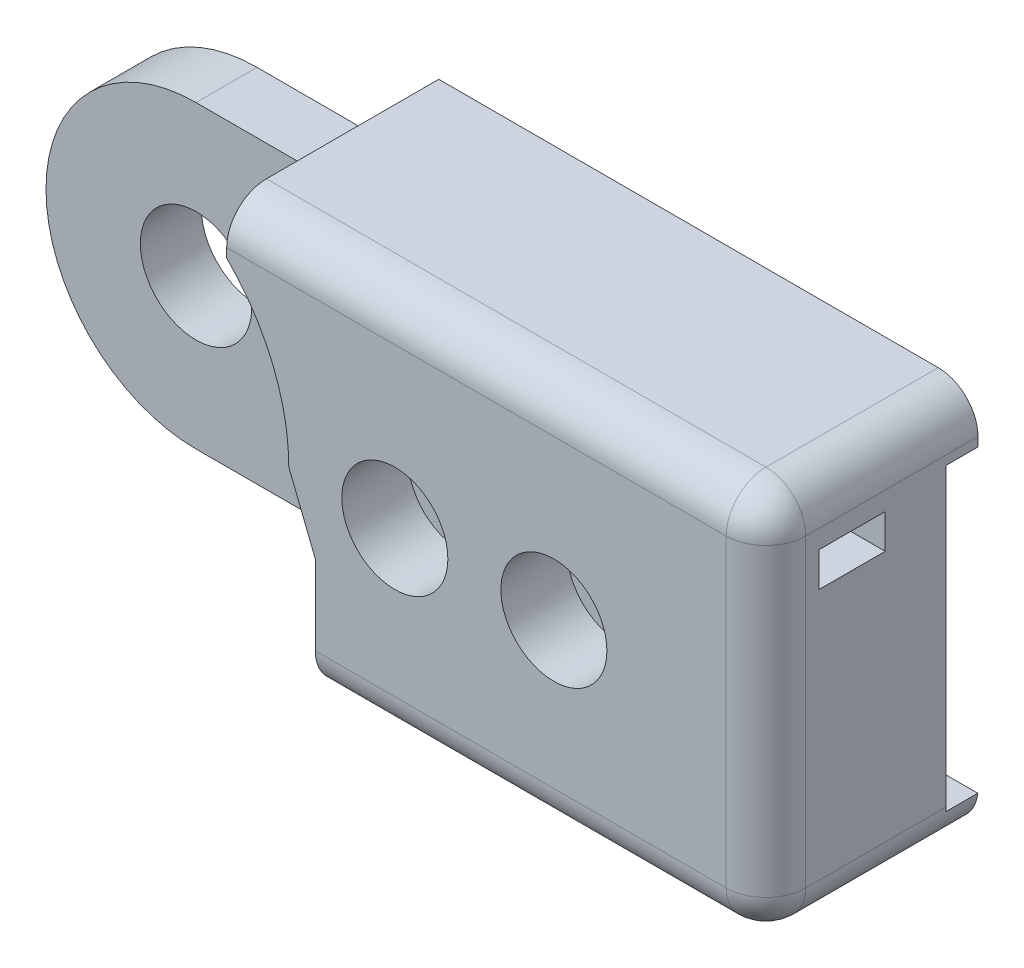
ISO-10303-21;
HEADER;
FILE_DESCRIPTION(('STEP AP214'),'2;1');
FILE_NAME('part.step','',(''),(''),'','','');
FILE_SCHEMA(('AUTOMOTIVE_DESIGN { 1 0 10303 214 1 1 1 1 }'));
ENDSEC;
DATA;
#1=APPLICATION_CONTEXT('core data for automotive mechanical design processes');
#2=APPLICATION_PROTOCOL_DEFINITION('international standard','automotive_design',2000,#1);
#3=PRODUCT_CONTEXT('',#1,'mechanical');
#4=PRODUCT('Part','Part','',(#3));
#5=PRODUCT_RELATED_PRODUCT_CATEGORY('part','',(#4));
#6=PRODUCT_DEFINITION_FORMATION('','',#4);
#7=PRODUCT_DEFINITION_CONTEXT('part definition',#1,'design');
#8=PRODUCT_DEFINITION('design','',#6,#7);
#9=PRODUCT_DEFINITION_SHAPE('','',#8);
#10=(LENGTH_UNIT() NAMED_UNIT(*) SI_UNIT(.MILLI.,.METRE.));
#11=(NAMED_UNIT(*) PLANE_ANGLE_UNIT() SI_UNIT($,.RADIAN.));
#12=(NAMED_UNIT(*) SI_UNIT($,.STERADIAN.) SOLID_ANGLE_UNIT());
#13=UNCERTAINTY_MEASURE_WITH_UNIT(LENGTH_MEASURE(1.E-05),#10,'distance_accuracy_value','');
#14=(GEOMETRIC_REPRESENTATION_CONTEXT(3) GLOBAL_UNCERTAINTY_ASSIGNED_CONTEXT((#13)) GLOBAL_UNIT_ASSIGNED_CONTEXT((#10,
#11,#12)) REPRESENTATION_CONTEXT('',''));
#15=CARTESIAN_POINT('',(0.,0.,0.));
#16=DIRECTION('',(0.,0.,1.));
#17=DIRECTION('',(1.,0.,0.));
#18=AXIS2_PLACEMENT_3D('',#15,#16,#17);
#19=CARTESIAN_POINT('',(0.,0.,-4.8));
#20=DIRECTION('',(0.,0.,-1.));
#21=DIRECTION('',(-1.,0.,0.));
#22=AXIS2_PLACEMENT_3D('',#19,#20,#21);
#23=PLANE('',#22);
#24=CARTESIAN_POINT('',(18.,0.,-4.8));
#25=DIRECTION('',(0.,0.,-1.));
#26=DIRECTION('',(-1.,0.,0.));
#27=AXIS2_PLACEMENT_3D('',#24,#25,#26);
#28=CIRCLE('',#27,2.5);
#29=CARTESIAN_POINT('',(15.5,0.,-4.8));
#30=VERTEX_POINT('',#29);
#31=EDGE_CURVE('E275',#30,#30,#28,.T.);
#32=ORIENTED_EDGE('',*,*,#31,.F.);
#33=EDGE_LOOP('',(#32));
#34=FACE_BOUND('',#33,.T.);
#35=CARTESIAN_POINT('',(12.,0.,-4.8));
#36=DIRECTION('',(0.,0.,-1.));
#37=DIRECTION('',(-1.,0.,0.));
#38=AXIS2_PLACEMENT_3D('',#35,#36,#37);
#39=CIRCLE('',#38,2.5);
#40=CARTESIAN_POINT('',(9.50000000000001,0.,-4.8));
#41=VERTEX_POINT('',#40);
#42=EDGE_CURVE('E285',#41,#41,#39,.T.);
#43=ORIENTED_EDGE('',*,*,#42,.F.);
#44=EDGE_LOOP('',(#43));
#45=FACE_BOUND('',#44,.T.);
#46=CARTESIAN_POINT('',(0.,0.,-4.8));
#47=DIRECTION('',(0.,0.,-1.));
#48=DIRECTION('',(-1.,0.,0.));
#49=AXIS2_PLACEMENT_3D('',#46,#47,#48);
#50=CIRCLE('',#49,2.1);
#51=CARTESIAN_POINT('',(-2.1,0.,-4.8));
#52=VERTEX_POINT('',#51);
#53=EDGE_CURVE('E293',#52,#52,#50,.T.);
#54=ORIENTED_EDGE('',*,*,#53,.F.);
#55=EDGE_LOOP('',(#54));
#56=FACE_BOUND('',#55,.T.);
#57=DIRECTION('',(0.,-1.,0.));
#58=VECTOR('',#57,1.);
#59=CARTESIAN_POINT('',(26.,0.,-4.8));
#60=LINE('',#59,#58);
#61=CARTESIAN_POINT('',(26.,5.65685424949239,-4.8));
#62=VERTEX_POINT('',#61);
#63=CARTESIAN_POINT('',(26.,-5.50163526528755,-4.8));
#64=VERTEX_POINT('',#63);
#65=EDGE_CURVE('E316',#62,#64,#60,.T.);
#66=ORIENTED_EDGE('',*,*,#65,.T.);
#67=CARTESIAN_POINT('',(24.5,-5.50163526528755,-4.8));
#68=DIRECTION('',(0.,0.,-1.));
#69=DIRECTION('',(-1.,0.,0.));
#70=AXIS2_PLACEMENT_3D('',#67,#68,#69);
#71=CIRCLE('',#70,1.5);
#72=CARTESIAN_POINT('',(25.9916168703616,-5.6599991249669,-4.8));
#73=VERTEX_POINT('',#72);
#74=EDGE_CURVE('E450',#64,#73,#71,.T.);
#75=ORIENTED_EDGE('',*,*,#74,.T.);
#76=DIRECTION('',(1.,0.,0.));
#77=VECTOR('',#76,1.);
#78=CARTESIAN_POINT('',(9.00000000000001,-5.6599991249669,-4.8));
#79=LINE('',#78,#77);
#80=CARTESIAN_POINT('',(9.00000000000001,-5.6599991249669,-4.8));
#81=VERTEX_POINT('',#80);
#82=EDGE_CURVE('E209',#81,#73,#79,.T.);
#83=ORIENTED_EDGE('',*,*,#82,.F.);
#84=DIRECTION('',(-1.,0.,0.));
#85=VECTOR('',#84,1.);
#86=CARTESIAN_POINT('',(0.,-5.6599991249669,-4.8));
#87=LINE('',#86,#85);
#88=CARTESIAN_POINT('',(0.,-5.6599991249669,-4.8));
#89=VERTEX_POINT('',#88);
#90=EDGE_CURVE('E305',#81,#89,#87,.T.);
#91=ORIENTED_EDGE('',*,*,#90,.T.);
#92=CARTESIAN_POINT('',(0.,0.,-4.8));
#93=DIRECTION('',(0.,0.,-1.));
#94=DIRECTION('',(-1.,0.,0.));
#95=AXIS2_PLACEMENT_3D('',#92,#93,#94);
#96=CIRCLE('',#95,5.65999868763295);
#97=CARTESIAN_POINT('',(0.,5.65999912496691,-4.8));
#98=VERTEX_POINT('',#97);
#99=EDGE_CURVE('E309',#89,#98,#96,.T.);
#100=ORIENTED_EDGE('',*,*,#99,.T.);
#101=DIRECTION('',(0.999999845465009,-0.000555940607591913,0.));
#102=VECTOR('',#101,1.);
#103=CARTESIAN_POINT('',(0.00314662286624039,5.65999737563121,-4.8));
#104=LINE('',#103,#102);
#105=CARTESIAN_POINT('',(5.65685424949238,5.65685424949239,-4.8));
#106=VERTEX_POINT('',#105);
#107=EDGE_CURVE('E313',#98,#106,#104,.T.);
#108=ORIENTED_EDGE('',*,*,#107,.T.);
#109=DIRECTION('',(-1.,0.,0.));
#110=VECTOR('',#109,1.);
#111=CARTESIAN_POINT('',(26.,5.65685424949239,-4.8));
#112=LINE('',#111,#110);
#113=EDGE_CURVE('E228',#62,#106,#112,.T.);
#114=ORIENTED_EDGE('',*,*,#113,.F.);
#115=EDGE_LOOP('',(#66,#75,#83,#91,#100,#108,#114));
#116=FACE_BOUND('',#115,.T.);
#117=ADVANCED_FACE('F40',(#34,#45,#56,#116),#23,.T.);
#118=CARTESIAN_POINT('',(18.,0.,3.2));
#119=DIRECTION('',(0.,0.,-1.));
#120=DIRECTION('',(-1.,0.,0.));
#121=AXIS2_PLACEMENT_3D('',#118,#119,#120);
#122=CYLINDRICAL_SURFACE('',#121,0.950000000000001);
#123=CARTESIAN_POINT('',(18.,0.,-6.));
#124=DIRECTION('',(0.,0.,-1.));
#125=DIRECTION('',(-1.,0.,0.));
#126=AXIS2_PLACEMENT_3D('',#123,#124,#125);
#127=CIRCLE('',#126,0.950000000000001);
#128=CARTESIAN_POINT('',(17.05,0.,-6.));
#129=VERTEX_POINT('',#128);
#130=EDGE_CURVE('E271',#129,#129,#127,.T.);
#131=ORIENTED_EDGE('',*,*,#130,.T.);
#132=EDGE_LOOP('',(#131));
#133=FACE_BOUND('',#132,.T.);
#134=CARTESIAN_POINT('',(18.,0.,-0.5));
#135=DIRECTION('',(0.,0.,1.));
#136=DIRECTION('',(1.,0.,0.));
#137=AXIS2_PLACEMENT_3D('',#134,#135,#136);
#138=CIRCLE('',#137,0.950000000000001);
#139=CARTESIAN_POINT('',(18.95,0.,-0.5));
#140=VERTEX_POINT('',#139);
#141=EDGE_CURVE('E280',#140,#140,#138,.F.);
#142=ORIENTED_EDGE('',*,*,#141,.F.);
#143=EDGE_LOOP('',(#142));
#144=FACE_BOUND('',#143,.T.);
#145=ADVANCED_FACE('F573',(#133,#144),#122,.F.);
#146=CARTESIAN_POINT('',(12.,0.,3.2));
#147=DIRECTION('',(0.,0.,-1.));
#148=DIRECTION('',(-1.,0.,0.));
#149=AXIS2_PLACEMENT_3D('',#146,#147,#148);
#150=CYLINDRICAL_SURFACE('',#149,0.949999999999999);
#151=CARTESIAN_POINT('',(12.,0.,-6.));
#152=DIRECTION('',(0.,0.,-1.));
#153=DIRECTION('',(-1.,0.,0.));
#154=AXIS2_PLACEMENT_3D('',#151,#152,#153);
#155=CIRCLE('',#154,0.949999999999999);
#156=CARTESIAN_POINT('',(11.05,0.,-6.));
#157=VERTEX_POINT('',#156);
#158=EDGE_CURVE('E276',#157,#157,#155,.T.);
#159=ORIENTED_EDGE('',*,*,#158,.T.);
#160=EDGE_LOOP('',(#159));
#161=FACE_BOUND('',#160,.T.);
#162=CARTESIAN_POINT('',(12.,0.,-0.5));
#163=DIRECTION('',(0.,0.,1.));
#164=DIRECTION('',(1.,0.,0.));
#165=AXIS2_PLACEMENT_3D('',#162,#163,#164);
#166=CIRCLE('',#165,0.949999999999999);
#167=CARTESIAN_POINT('',(12.95,0.,-0.5));
#168=VERTEX_POINT('',#167);
#169=EDGE_CURVE('E259',#168,#168,#166,.F.);
#170=ORIENTED_EDGE('',*,*,#169,.F.);
#171=EDGE_LOOP('',(#170));
#172=FACE_BOUND('',#171,.T.);
#173=ADVANCED_FACE('F579',(#161,#172),#150,.F.);
#174=CARTESIAN_POINT('',(0.,0.,2.));
#175=DIRECTION('',(0.,0.,-1.));
#176=DIRECTION('',(-1.,0.,0.));
#177=AXIS2_PLACEMENT_3D('',#174,#175,#176);
#178=CYLINDRICAL_SURFACE('',#177,8.00000000000001);
#179=CARTESIAN_POINT('',(0.,0.,-2.5));
#180=DIRECTION('',(0.,0.,1.));
#181=DIRECTION('',(-1.,0.,0.));
#182=AXIS2_PLACEMENT_3D('',#179,#180,#181);
#183=CIRCLE('',#182,8.00000000000001);
#184=CARTESIAN_POINT('',(5.99394120241067,5.29836473471238,-2.5));
#185=VERTEX_POINT('',#184);
#186=CARTESIAN_POINT('',(5.65685424949238,5.65685424949239,-2.5));
#187=VERTEX_POINT('',#186);
#188=EDGE_CURVE('E382',#185,#187,#183,.T.);
#189=ORIENTED_EDGE('',*,*,#188,.F.);
#190=DIRECTION('',(0.,0.,-1.));
#191=VECTOR('',#190,1.);
#192=CARTESIAN_POINT('',(5.99394120241067,5.29836473471238,2.));
#193=LINE('',#192,#191);
#194=CARTESIAN_POINT('',(5.99394120241067,5.29836473471238,0.));
#195=VERTEX_POINT('',#194);
#196=EDGE_CURVE('E371',#185,#195,#193,.F.);
#197=ORIENTED_EDGE('',*,*,#196,.T.);
#198=CARTESIAN_POINT('',(0.,0.,0.));
#199=DIRECTION('',(0.,0.,1.));
#200=DIRECTION('',(1.,0.,0.));
#201=AXIS2_PLACEMENT_3D('',#198,#199,#200);
#202=CIRCLE('',#201,8.00000000000001);
#203=CARTESIAN_POINT('',(6.9291470938499,3.99836473471238,0.));
#204=VERTEX_POINT('',#203);
#205=EDGE_CURVE('E375',#195,#204,#202,.F.);
#206=ORIENTED_EDGE('',*,*,#205,.T.);
#207=DIRECTION('',(0.,0.,-1.));
#208=VECTOR('',#207,1.);
#209=CARTESIAN_POINT('',(6.9291470938499,3.99836473471238,2.));
#210=LINE('',#209,#208);
#211=CARTESIAN_POINT('',(6.9291470938499,3.99836473471238,-2.5));
#212=VERTEX_POINT('',#211);
#213=EDGE_CURVE('E363',#204,#212,#210,.T.);
#214=ORIENTED_EDGE('',*,*,#213,.T.);
#215=CARTESIAN_POINT('',(8.00000000000001,0.,-2.5));
#216=VERTEX_POINT('',#215);
#217=EDGE_CURVE('E383',#216,#212,#183,.T.);
#218=ORIENTED_EDGE('',*,*,#217,.F.);
#219=DIRECTION('',(0.,0.,-1.));
#220=VECTOR('',#219,1.);
#221=CARTESIAN_POINT('',(8.00000000000001,0.,2.));
#222=LINE('',#221,#220);
#223=CARTESIAN_POINT('',(8.00000000000001,0.,2.));
#224=VERTEX_POINT('',#223);
#225=EDGE_CURVE('E409',#224,#216,#222,.T.);
#226=ORIENTED_EDGE('',*,*,#225,.F.);
#227=CARTESIAN_POINT('',(0.,0.,2.));
#228=DIRECTION('',(0.,0.,-1.));
#229=DIRECTION('',(1.,0.,0.));
#230=AXIS2_PLACEMENT_3D('',#227,#228,#229);
#231=CIRCLE('',#230,8.00000000000001);
#232=CARTESIAN_POINT('',(5.65685424949238,5.65685424949239,2.));
#233=VERTEX_POINT('',#232);
#234=EDGE_CURVE('E386',#233,#224,#231,.T.);
#235=ORIENTED_EDGE('',*,*,#234,.F.);
#236=DIRECTION('',(0.,0.,-1.));
#237=VECTOR('',#236,1.);
#238=CARTESIAN_POINT('',(5.65685424949238,5.65685424949239,2.));
#239=LINE('',#238,#237);
#240=EDGE_CURVE('E400',#233,#187,#239,.T.);
#241=ORIENTED_EDGE('',*,*,#240,.T.);
#242=EDGE_LOOP('',(#189,#197,#206,#214,#218,#226,#235,#241));
#243=FACE_BOUND('',#242,.T.);
#244=ADVANCED_FACE('F630',(#243),#178,.F.);
#245=CARTESIAN_POINT('',(8.00000000000001,0.,2.));
#246=DIRECTION('',(0.92856038867315,0.371181363469624,0.));
#247=DIRECTION('',(-0.371181363469624,0.92856038867315,0.));
#248=AXIS2_PLACEMENT_3D('',#245,#246,#247);
#249=PLANE('',#248);
#250=ORIENTED_EDGE('',*,*,#225,.T.);
#251=DIRECTION('',(-0.371181363469624,0.92856038867315,0.));
#252=VECTOR('',#251,1.);
#253=CARTESIAN_POINT('',(8.00000000000001,0.,-2.5));
#254=LINE('',#253,#252);
#255=CARTESIAN_POINT('',(9.00000000000001,-2.50163526528762,-2.5));
#256=VERTEX_POINT('',#255);
#257=EDGE_CURVE('E379',#256,#216,#254,.T.);
#258=ORIENTED_EDGE('',*,*,#257,.F.);
#259=DIRECTION('',(0.,0.,-1.));
#260=VECTOR('',#259,1.);
#261=CARTESIAN_POINT('',(9.00000000000001,-2.50163526528762,2.));
#262=LINE('',#261,#260);
#263=CARTESIAN_POINT('',(9.00000000000001,-2.50163526528762,2.));
#264=VERTEX_POINT('',#263);
#265=EDGE_CURVE('E198',#264,#256,#262,.T.);
#266=ORIENTED_EDGE('',*,*,#265,.F.);
#267=DIRECTION('',(0.371181363469624,-0.92856038867315,0.));
#268=VECTOR('',#267,1.);
#269=CARTESIAN_POINT('',(8.00000000000001,0.,2.));
#270=LINE('',#269,#268);
#271=EDGE_CURVE('E390',#224,#264,#270,.T.);
#272=ORIENTED_EDGE('',*,*,#271,.F.);
#273=EDGE_LOOP('',(#250,#258,#266,#272));
#274=FACE_BOUND('',#273,.T.);
#275=ADVANCED_FACE('F517',(#274),#249,.F.);
#276=CARTESIAN_POINT('',(9.00000000000001,-7.00163526528755,2.));
#277=DIRECTION('',(1.,0.,0.));
#278=DIRECTION('',(0.,0.,-1.));
#279=AXIS2_PLACEMENT_3D('',#276,#277,#278);
#280=PLANE('',#279);
#281=DIRECTION('',(0.,0.,-1.));
#282=VECTOR('',#281,1.);
#283=CARTESIAN_POINT('',(9.00000000000001,-7.00163526528755,2.));
#284=LINE('',#283,#282);
#285=CARTESIAN_POINT('',(9.00000000000001,-7.00163526528755,0.5));
#286=VERTEX_POINT('',#285);
#287=CARTESIAN_POINT('',(9.00000000000001,-7.00163526528755,-6.));
#288=VERTEX_POINT('',#287);
#289=EDGE_CURVE('E187',#286,#288,#284,.T.);
#290=ORIENTED_EDGE('',*,*,#289,.F.);
#291=CARTESIAN_POINT('',(9.00000000000001,-5.50163526528755,0.5));
#292=DIRECTION('',(1.,0.,0.));
#293=DIRECTION('',(0.,0.,-1.));
#294=AXIS2_PLACEMENT_3D('',#291,#292,#293);
#295=CIRCLE('',#294,1.5);
#296=CARTESIAN_POINT('',(9.00000000000001,-5.50163526528755,2.));
#297=VERTEX_POINT('',#296);
#298=EDGE_CURVE('E463',#286,#297,#295,.F.);
#299=ORIENTED_EDGE('',*,*,#298,.T.);
#300=DIRECTION('',(0.,-1.,0.));
#301=VECTOR('',#300,1.);
#302=CARTESIAN_POINT('',(9.00000000000001,-7.00163526528755,2.));
#303=LINE('',#302,#301);
#304=EDGE_CURVE('E393',#264,#297,#303,.T.);
#305=ORIENTED_EDGE('',*,*,#304,.F.);
#306=ORIENTED_EDGE('',*,*,#265,.T.);
#307=DIRECTION('',(0.,1.,0.));
#308=VECTOR('',#307,1.);
#309=CARTESIAN_POINT('',(9.00000000000001,-7.00163526528755,-2.5));
#310=LINE('',#309,#308);
#311=CARTESIAN_POINT('',(9.00000000000001,-5.6599991249669,-2.5));
#312=VERTEX_POINT('',#311);
#313=EDGE_CURVE('E348',#312,#256,#310,.T.);
#314=ORIENTED_EDGE('',*,*,#313,.F.);
#315=DIRECTION('',(0.,0.,1.));
#316=VECTOR('',#315,1.);
#317=CARTESIAN_POINT('',(9.00000000000001,-5.6599991249669,-4.8));
#318=LINE('',#317,#316);
#319=EDGE_CURVE('E320',#81,#312,#318,.T.);
#320=ORIENTED_EDGE('',*,*,#319,.F.);
#321=DIRECTION('',(0.,0.,1.));
#322=VECTOR('',#321,1.);
#323=CARTESIAN_POINT('',(9.00000000000001,-5.6599991249669,-6.));
#324=LINE('',#323,#322);
#325=CARTESIAN_POINT('',(9.00000000000001,-5.6599991249669,-6.));
#326=VERTEX_POINT('',#325);
#327=EDGE_CURVE('E214',#326,#81,#324,.T.);
#328=ORIENTED_EDGE('',*,*,#327,.F.);
#329=DIRECTION('',(0.,1.,0.));
#330=VECTOR('',#329,1.);
#331=CARTESIAN_POINT('',(9.00000000000001,-7.00163526528755,-6.));
#332=LINE('',#331,#330);
#333=EDGE_CURVE('E204',#288,#326,#332,.T.);
#334=ORIENTED_EDGE('',*,*,#333,.F.);
#335=EDGE_LOOP('',(#290,#299,#305,#306,#314,#320,#328,#334));
#336=FACE_BOUND('',#335,.T.);
#337=ADVANCED_FACE('F211',(#336),#280,.F.);
#338=CARTESIAN_POINT('',(26.,-7.00163526528755,2.));
#339=DIRECTION('',(0.,1.,0.));
#340=DIRECTION('',(-1.,0.,0.));
#341=AXIS2_PLACEMENT_3D('',#338,#339,#340);
#342=PLANE('',#341);
#343=CARTESIAN_POINT('',(22.,-7.00163526528755,-1.));
#344=DIRECTION('',(0.,-1.,0.));
#345=DIRECTION('',(1.,0.,0.));
#346=AXIS2_PLACEMENT_3D('',#343,#344,#345);
#347=CIRCLE('',#346,0.950000000000001);
#348=CARTESIAN_POINT('',(22.95,-7.00163526528755,-1.));
#349=VERTEX_POINT('',#348);
#350=EDGE_CURVE('E676',#349,#349,#347,.T.);
#351=ORIENTED_EDGE('',*,*,#350,.F.);
#352=EDGE_LOOP('',(#351));
#353=FACE_BOUND('',#352,.T.);
#354=CARTESIAN_POINT('',(18.,-7.00163526528755,-1.));
#355=DIRECTION('',(0.,-1.,0.));
#356=DIRECTION('',(1.,0.,0.));
#357=AXIS2_PLACEMENT_3D('',#354,#355,#356);
#358=CIRCLE('',#357,0.950000000000001);
#359=CARTESIAN_POINT('',(18.95,-7.00163526528755,-1.));
#360=VERTEX_POINT('',#359);
#361=EDGE_CURVE('E685',#360,#360,#358,.T.);
#362=ORIENTED_EDGE('',*,*,#361,.F.);
#363=EDGE_LOOP('',(#362));
#364=FACE_BOUND('',#363,.T.);
#365=DIRECTION('',(-1.,0.,0.));
#366=VECTOR('',#365,1.);
#367=CARTESIAN_POINT('',(26.,-7.00163526528755,-6.));
#368=LINE('',#367,#366);
#369=CARTESIAN_POINT('',(24.5,-7.00163526528755,-6.));
#370=VERTEX_POINT('',#369);
#371=EDGE_CURVE('E190',#370,#288,#368,.T.);
#372=ORIENTED_EDGE('',*,*,#371,.F.);
#373=DIRECTION('',(0.,0.,-1.));
#374=VECTOR('',#373,1.);
#375=CARTESIAN_POINT('',(24.5,-7.00163526528755,2.));
#376=LINE('',#375,#374);
#377=CARTESIAN_POINT('',(24.5,-7.00163526528755,0.5));
#378=VERTEX_POINT('',#377);
#379=EDGE_CURVE('E460',#370,#378,#376,.F.);
#380=ORIENTED_EDGE('',*,*,#379,.T.);
#381=DIRECTION('',(1.,0.,0.));
#382=VECTOR('',#381,1.);
#383=CARTESIAN_POINT('',(9.00000000000001,-7.00163526528755,0.5));
#384=LINE('',#383,#382);
#385=EDGE_CURVE('E193',#378,#286,#384,.F.);
#386=ORIENTED_EDGE('',*,*,#385,.T.);
#387=ORIENTED_EDGE('',*,*,#289,.T.);
#388=EDGE_LOOP('',(#372,#380,#386,#387));
#389=FACE_BOUND('',#388,.T.);
#390=ADVANCED_FACE('F189',(#353,#364,#389),#342,.F.);
#391=CARTESIAN_POINT('',(26.,-7.00163526528755,2.));
#392=DIRECTION('',(-1.,0.,0.));
#393=DIRECTION('',(0.,0.,1.));
#394=AXIS2_PLACEMENT_3D('',#391,#392,#393);
#395=PLANE('',#394);
#396=DIRECTION('',(0.,0.,-1.));
#397=VECTOR('',#396,1.);
#398=CARTESIAN_POINT('',(26.,5.29836473471238,2.));
#399=LINE('',#398,#397);
#400=CARTESIAN_POINT('',(26.,5.29836473471238,0.));
#401=VERTEX_POINT('',#400);
#402=CARTESIAN_POINT('',(26.,5.29836473471238,-2.5));
#403=VERTEX_POINT('',#402);
#404=EDGE_CURVE('E367',#401,#403,#399,.T.);
#405=ORIENTED_EDGE('',*,*,#404,.T.);
#406=DIRECTION('',(0.,-1.,0.));
#407=VECTOR('',#406,1.);
#408=CARTESIAN_POINT('',(26.,0.,-2.5));
#409=LINE('',#408,#407);
#410=CARTESIAN_POINT('',(26.,3.99836473471238,-2.5));
#411=VERTEX_POINT('',#410);
#412=EDGE_CURVE('E310',#403,#411,#409,.T.);
#413=ORIENTED_EDGE('',*,*,#412,.T.);
#414=DIRECTION('',(0.,0.,1.));
#415=VECTOR('',#414,1.);
#416=CARTESIAN_POINT('',(26.,3.99836473471238,2.));
#417=LINE('',#416,#415);
#418=CARTESIAN_POINT('',(26.,3.99836473471238,0.));
#419=VERTEX_POINT('',#418);
#420=EDGE_CURVE('E359',#411,#419,#417,.T.);
#421=ORIENTED_EDGE('',*,*,#420,.T.);
#422=DIRECTION('',(0.,1.,0.));
#423=VECTOR('',#422,1.);
#424=CARTESIAN_POINT('',(26.,-7.00163526528755,0.));
#425=LINE('',#424,#423);
#426=EDGE_CURVE('E421',#419,#401,#425,.T.);
#427=ORIENTED_EDGE('',*,*,#426,.T.);
#428=EDGE_LOOP('',(#405,#413,#421,#427));
#429=FACE_BOUND('',#428,.T.);
#430=DIRECTION('',(0.,1.,0.));
#431=VECTOR('',#430,1.);
#432=CARTESIAN_POINT('',(26.,-7.00163526528755,0.5));
#433=LINE('',#432,#431);
#434=CARTESIAN_POINT('',(26.,5.99836473471239,0.5));
#435=VERTEX_POINT('',#434);
#436=CARTESIAN_POINT('',(26.,-5.50163526528755,0.5));
#437=VERTEX_POINT('',#436);
#438=EDGE_CURVE('E444',#435,#437,#433,.F.);
#439=ORIENTED_EDGE('',*,*,#438,.T.);
#440=DIRECTION('',(0.,0.,-1.));
#441=VECTOR('',#440,1.);
#442=CARTESIAN_POINT('',(26.,-5.50163526528755,2.));
#443=LINE('',#442,#441);
#444=EDGE_CURVE('E447',#437,#64,#443,.T.);
#445=ORIENTED_EDGE('',*,*,#444,.T.);
#446=ORIENTED_EDGE('',*,*,#65,.F.);
#447=DIRECTION('',(0.,0.,1.));
#448=VECTOR('',#447,1.);
#449=CARTESIAN_POINT('',(26.,5.65685424949239,-6.));
#450=LINE('',#449,#448);
#451=CARTESIAN_POINT('',(26.,5.65685424949239,-6.));
#452=VERTEX_POINT('',#451);
#453=EDGE_CURVE('E243',#452,#62,#450,.T.);
#454=ORIENTED_EDGE('',*,*,#453,.F.);
#455=DIRECTION('',(0.,-1.,0.));
#456=VECTOR('',#455,1.);
#457=CARTESIAN_POINT('',(26.,7.49836473471239,-6.));
#458=LINE('',#457,#456);
#459=CARTESIAN_POINT('',(26.,5.99836473471239,-6.));
#460=VERTEX_POINT('',#459);
#461=EDGE_CURVE('E240',#460,#452,#458,.T.);
#462=ORIENTED_EDGE('',*,*,#461,.F.);
#463=DIRECTION('',(0.,0.,-1.));
#464=VECTOR('',#463,1.);
#465=CARTESIAN_POINT('',(26.,5.99836473471239,2.));
#466=LINE('',#465,#464);
#467=EDGE_CURVE('E441',#460,#435,#466,.F.);
#468=ORIENTED_EDGE('',*,*,#467,.T.);
#469=EDGE_LOOP('',(#439,#445,#446,#454,#462,#468));
#470=FACE_BOUND('',#469,.T.);
#471=ADVANCED_FACE('F536',(#429,#470),#395,.F.);
#472=CARTESIAN_POINT('',(5.65685424949238,7.49836473471238,2.));
#473=DIRECTION('',(0.,-1.,0.));
#474=DIRECTION('',(1.,0.,0.));
#475=AXIS2_PLACEMENT_3D('',#472,#473,#474);
#476=PLANE('',#475);
#477=DIRECTION('',(0.,0.,-1.));
#478=VECTOR('',#477,1.);
#479=CARTESIAN_POINT('',(5.65685424949238,7.49836473471238,2.));
#480=LINE('',#479,#478);
#481=CARTESIAN_POINT('',(5.65685424949238,7.49836473471238,0.5));
#482=VERTEX_POINT('',#481);
#483=CARTESIAN_POINT('',(5.65685424949238,7.49836473471238,-6.));
#484=VERTEX_POINT('',#483);
#485=EDGE_CURVE('E199',#482,#484,#480,.T.);
#486=ORIENTED_EDGE('',*,*,#485,.F.);
#487=DIRECTION('',(-1.,0.,0.));
#488=VECTOR('',#487,1.);
#489=CARTESIAN_POINT('',(26.,7.49836473471239,0.5));
#490=LINE('',#489,#488);
#491=CARTESIAN_POINT('',(24.5,7.49836473471239,0.5));
#492=VERTEX_POINT('',#491);
#493=EDGE_CURVE('E50',#482,#492,#490,.F.);
#494=ORIENTED_EDGE('',*,*,#493,.T.);
#495=DIRECTION('',(0.,0.,-1.));
#496=VECTOR('',#495,1.);
#497=CARTESIAN_POINT('',(24.5,7.49836473471239,2.));
#498=LINE('',#497,#496);
#499=CARTESIAN_POINT('',(24.5,7.49836473471239,-6.));
#500=VERTEX_POINT('',#499);
#501=EDGE_CURVE('E61',#492,#500,#498,.T.);
#502=ORIENTED_EDGE('',*,*,#501,.T.);
#503=DIRECTION('',(1.,0.,0.));
#504=VECTOR('',#503,1.);
#505=CARTESIAN_POINT('',(5.65685424949238,7.49836473471238,-6.));
#506=LINE('',#505,#504);
#507=EDGE_CURVE('E237',#484,#500,#506,.T.);
#508=ORIENTED_EDGE('',*,*,#507,.F.);
#509=EDGE_LOOP('',(#486,#494,#502,#508));
#510=FACE_BOUND('',#509,.T.);
#511=ADVANCED_FACE('F553',(#510),#476,.F.);
#512=CARTESIAN_POINT('',(5.65685424949238,5.65685424949239,2.));
#513=DIRECTION('',(1.,0.,0.));
#514=DIRECTION('',(0.,0.,-1.));
#515=AXIS2_PLACEMENT_3D('',#512,#513,#514);
#516=PLANE('',#515);
#517=DIRECTION('',(0.,-1.,0.));
#518=VECTOR('',#517,1.);
#519=CARTESIAN_POINT('',(5.65685424949238,5.65685424949239,2.));
#520=LINE('',#519,#518);
#521=CARTESIAN_POINT('',(5.65685424949238,5.99836473471239,2.));
#522=VERTEX_POINT('',#521);
#523=EDGE_CURVE('E397',#522,#233,#520,.T.);
#524=ORIENTED_EDGE('',*,*,#523,.F.);
#525=CARTESIAN_POINT('',(5.65685424949238,5.99836473471239,0.5));
#526=DIRECTION('',(1.,0.,0.));
#527=DIRECTION('',(0.,0.,-1.));
#528=AXIS2_PLACEMENT_3D('',#525,#526,#527);
#529=CIRCLE('',#528,1.5);
#530=EDGE_CURVE('E466',#522,#482,#529,.F.);
#531=ORIENTED_EDGE('',*,*,#530,.T.);
#532=ORIENTED_EDGE('',*,*,#485,.T.);
#533=DIRECTION('',(0.,1.,0.));
#534=VECTOR('',#533,1.);
#535=CARTESIAN_POINT('',(5.65685424949238,5.65685424949239,-6.));
#536=LINE('',#535,#534);
#537=CARTESIAN_POINT('',(5.65685424949238,5.65685424949239,-6.));
#538=VERTEX_POINT('',#537);
#539=EDGE_CURVE('E233',#538,#484,#536,.T.);
#540=ORIENTED_EDGE('',*,*,#539,.F.);
#541=DIRECTION('',(0.,0.,1.));
#542=VECTOR('',#541,1.);
#543=CARTESIAN_POINT('',(5.65685424949238,5.65685424949239,-6.));
#544=LINE('',#543,#542);
#545=EDGE_CURVE('E250',#538,#106,#544,.T.);
#546=ORIENTED_EDGE('',*,*,#545,.T.);
#547=DIRECTION('',(0.,0.,1.));
#548=VECTOR('',#547,1.);
#549=CARTESIAN_POINT('',(5.65685424949238,5.65685424949239,-4.8));
#550=LINE('',#549,#548);
#551=EDGE_CURVE('E336',#106,#187,#550,.T.);
#552=ORIENTED_EDGE('',*,*,#551,.T.);
#553=ORIENTED_EDGE('',*,*,#240,.F.);
#554=EDGE_LOOP('',(#524,#531,#532,#540,#546,#552,#553));
#555=FACE_BOUND('',#554,.T.);
#556=ADVANCED_FACE('F551',(#555),#516,.F.);
#557=CARTESIAN_POINT('',(0.,0.,2.));
#558=DIRECTION('',(0.,0.,1.));
#559=DIRECTION('',(1.,0.,0.));
#560=AXIS2_PLACEMENT_3D('',#557,#558,#559);
#561=PLANE('',#560);
#562=CARTESIAN_POINT('',(12.,0.,2.));
#563=DIRECTION('',(0.,0.,1.));
#564=DIRECTION('',(1.,0.,0.));
#565=AXIS2_PLACEMENT_3D('',#562,#563,#564);
#566=CIRCLE('',#565,2.);
#567=CARTESIAN_POINT('',(14.,0.,2.));
#568=VERTEX_POINT('',#567);
#569=EDGE_CURVE('E260',#568,#568,#566,.T.);
#570=ORIENTED_EDGE('',*,*,#569,.F.);
#571=EDGE_LOOP('',(#570));
#572=FACE_BOUND('',#571,.T.);
#573=CARTESIAN_POINT('',(18.,0.,2.));
#574=DIRECTION('',(0.,0.,1.));
#575=DIRECTION('',(1.,0.,0.));
#576=AXIS2_PLACEMENT_3D('',#573,#574,#575);
#577=CIRCLE('',#576,2.);
#578=CARTESIAN_POINT('',(20.,0.,2.));
#579=VERTEX_POINT('',#578);
#580=EDGE_CURVE('E254',#579,#579,#577,.T.);
#581=ORIENTED_EDGE('',*,*,#580,.F.);
#582=EDGE_LOOP('',(#581));
#583=FACE_BOUND('',#582,.T.);
#584=ORIENTED_EDGE('',*,*,#304,.T.);
#585=DIRECTION('',(1.,0.,0.));
#586=VECTOR('',#585,1.);
#587=CARTESIAN_POINT('',(26.,-5.50163526528755,2.));
#588=LINE('',#587,#586);
#589=CARTESIAN_POINT('',(24.5,-5.50163526528755,2.));
#590=VERTEX_POINT('',#589);
#591=EDGE_CURVE('E438',#297,#590,#588,.T.);
#592=ORIENTED_EDGE('',*,*,#591,.T.);
#593=DIRECTION('',(0.,1.,0.));
#594=VECTOR('',#593,1.);
#595=CARTESIAN_POINT('',(24.5,7.49836473471239,2.));
#596=LINE('',#595,#594);
#597=CARTESIAN_POINT('',(24.5,5.99836473471239,2.));
#598=VERTEX_POINT('',#597);
#599=EDGE_CURVE('E434',#590,#598,#596,.T.);
#600=ORIENTED_EDGE('',*,*,#599,.T.);
#601=DIRECTION('',(-1.,0.,0.));
#602=VECTOR('',#601,1.);
#603=CARTESIAN_POINT('',(5.65685424949238,5.99836473471239,2.));
#604=LINE('',#603,#602);
#605=EDGE_CURVE('E425',#598,#522,#604,.T.);
#606=ORIENTED_EDGE('',*,*,#605,.T.);
#607=ORIENTED_EDGE('',*,*,#523,.T.);
#608=ORIENTED_EDGE('',*,*,#234,.T.);
#609=ORIENTED_EDGE('',*,*,#271,.T.);
#610=EDGE_LOOP('',(#584,#592,#600,#606,#607,#608,#609));
#611=FACE_BOUND('',#610,.T.);
#612=ADVANCED_FACE('F506',(#572,#583,#611),#561,.T.);
#613=CARTESIAN_POINT('',(0.,0.,0.));
#614=DIRECTION('',(0.,0.,1.));
#615=DIRECTION('',(1.,0.,0.));
#616=AXIS2_PLACEMENT_3D('',#613,#614,#615);
#617=PLANE('',#616);
#618=DIRECTION('',(1.,0.,0.));
#619=VECTOR('',#618,1.);
#620=CARTESIAN_POINT('',(29.8495351115723,5.29836473471238,0.));
#621=LINE('',#620,#619);
#622=EDGE_CURVE('E351',#195,#401,#621,.T.);
#623=ORIENTED_EDGE('',*,*,#622,.T.);
#624=ORIENTED_EDGE('',*,*,#426,.F.);
#625=DIRECTION('',(-1.,0.,0.));
#626=VECTOR('',#625,1.);
#627=CARTESIAN_POINT('',(2.73814114815064,3.99836473471238,0.));
#628=LINE('',#627,#626);
#629=EDGE_CURVE('E355',#419,#204,#628,.T.);
#630=ORIENTED_EDGE('',*,*,#629,.T.);
#631=ORIENTED_EDGE('',*,*,#205,.F.);
#632=EDGE_LOOP('',(#623,#624,#630,#631));
#633=FACE_BOUND('',#632,.T.);
#634=ADVANCED_FACE('F602',(#633),#617,.F.);
#635=CARTESIAN_POINT('',(26.,5.29836473471238,0.));
#636=DIRECTION('',(0.,1.,0.));
#637=DIRECTION('',(0.,0.,1.));
#638=AXIS2_PLACEMENT_3D('',#635,#636,#637);
#639=PLANE('',#638);
#640=DIRECTION('',(1.,0.,0.));
#641=VECTOR('',#640,1.);
#642=CARTESIAN_POINT('',(0.,5.29836473471238,-2.5));
#643=LINE('',#642,#641);
#644=EDGE_CURVE('E417',#185,#403,#643,.T.);
#645=ORIENTED_EDGE('',*,*,#644,.T.);
#646=ORIENTED_EDGE('',*,*,#404,.F.);
#647=ORIENTED_EDGE('',*,*,#622,.F.);
#648=ORIENTED_EDGE('',*,*,#196,.F.);
#649=EDGE_LOOP('',(#645,#646,#647,#648));
#650=FACE_BOUND('',#649,.T.);
#651=ADVANCED_FACE('F605',(#650),#639,.F.);
#652=CARTESIAN_POINT('',(2.73814114815064,3.99836473471238,0.));
#653=DIRECTION('',(0.,-1.,0.));
#654=DIRECTION('',(1.,0.,0.));
#655=AXIS2_PLACEMENT_3D('',#652,#653,#654);
#656=PLANE('',#655);
#657=ORIENTED_EDGE('',*,*,#629,.F.);
#658=ORIENTED_EDGE('',*,*,#420,.F.);
#659=DIRECTION('',(-1.,0.,0.));
#660=VECTOR('',#659,1.);
#661=CARTESIAN_POINT('',(0.,3.99836473471238,-2.5));
#662=LINE('',#661,#660);
#663=EDGE_CURVE('E413',#411,#212,#662,.T.);
#664=ORIENTED_EDGE('',*,*,#663,.T.);
#665=ORIENTED_EDGE('',*,*,#213,.F.);
#666=EDGE_LOOP('',(#657,#658,#664,#665));
#667=FACE_BOUND('',#666,.T.);
#668=ADVANCED_FACE('F590',(#667),#656,.F.);
#669=CARTESIAN_POINT('',(0.,0.,-2.5));
#670=DIRECTION('',(0.,0.,-1.));
#671=DIRECTION('',(-1.,0.,0.));
#672=AXIS2_PLACEMENT_3D('',#669,#670,#671);
#673=PLANE('',#672);
#674=CARTESIAN_POINT('',(0.,0.,-2.5));
#675=DIRECTION('',(0.,0.,-1.));
#676=DIRECTION('',(-1.,0.,0.));
#677=AXIS2_PLACEMENT_3D('',#674,#675,#676);
#678=CIRCLE('',#677,2.1);
#679=CARTESIAN_POINT('',(-2.1,0.,-2.5));
#680=VERTEX_POINT('',#679);
#681=EDGE_CURVE('E300',#680,#680,#678,.T.);
#682=ORIENTED_EDGE('',*,*,#681,.T.);
#683=EDGE_LOOP('',(#682));
#684=FACE_BOUND('',#683,.T.);
#685=ORIENTED_EDGE('',*,*,#644,.F.);
#686=ORIENTED_EDGE('',*,*,#188,.T.);
#687=DIRECTION('',(0.999999845465009,-0.000555940607591913,0.));
#688=VECTOR('',#687,1.);
#689=CARTESIAN_POINT('',(0.00314662286624039,5.65999737563121,-2.5));
#690=LINE('',#689,#688);
#691=CARTESIAN_POINT('',(0.,5.65999912496691,-2.5));
#692=VERTEX_POINT('',#691);
#693=EDGE_CURVE('E327',#692,#187,#690,.T.);
#694=ORIENTED_EDGE('',*,*,#693,.F.);
#695=CARTESIAN_POINT('',(0.,0.,-2.5));
#696=DIRECTION('',(0.,0.,-1.));
#697=DIRECTION('',(-1.,0.,0.));
#698=AXIS2_PLACEMENT_3D('',#695,#696,#697);
#699=CIRCLE('',#698,5.65999868763295);
#700=CARTESIAN_POINT('',(0.,-5.6599991249669,-2.5));
#701=VERTEX_POINT('',#700);
#702=EDGE_CURVE('E324',#701,#692,#699,.T.);
#703=ORIENTED_EDGE('',*,*,#702,.F.);
#704=DIRECTION('',(-1.,0.,0.));
#705=VECTOR('',#704,1.);
#706=CARTESIAN_POINT('',(0.,-5.6599991249669,-2.5));
#707=LINE('',#706,#705);
#708=EDGE_CURVE('E304',#312,#701,#707,.T.);
#709=ORIENTED_EDGE('',*,*,#708,.F.);
#710=ORIENTED_EDGE('',*,*,#313,.T.);
#711=ORIENTED_EDGE('',*,*,#257,.T.);
#712=ORIENTED_EDGE('',*,*,#217,.T.);
#713=ORIENTED_EDGE('',*,*,#663,.F.);
#714=ORIENTED_EDGE('',*,*,#412,.F.);
#715=EDGE_LOOP('',(#685,#686,#694,#703,#709,#710,#711,#712,#713,#714));
#716=FACE_BOUND('',#715,.T.);
#717=ADVANCED_FACE('F521',(#684,#716),#673,.F.);
#718=CARTESIAN_POINT('',(0.,-5.6599991249669,-4.8));
#719=DIRECTION('',(0.,1.,0.));
#720=DIRECTION('',(0.,0.,1.));
#721=AXIS2_PLACEMENT_3D('',#718,#719,#720);
#722=PLANE('',#721);
#723=ORIENTED_EDGE('',*,*,#708,.T.);
#724=DIRECTION('',(0.,0.,1.));
#725=VECTOR('',#724,1.);
#726=CARTESIAN_POINT('',(0.,-5.6599991249669,-4.8));
#727=LINE('',#726,#725);
#728=EDGE_CURVE('E344',#89,#701,#727,.T.);
#729=ORIENTED_EDGE('',*,*,#728,.F.);
#730=ORIENTED_EDGE('',*,*,#90,.F.);
#731=ORIENTED_EDGE('',*,*,#319,.T.);
#732=EDGE_LOOP('',(#723,#729,#730,#731));
#733=FACE_BOUND('',#732,.T.);
#734=ADVANCED_FACE('F526',(#733),#722,.F.);
#735=CARTESIAN_POINT('',(0.,0.,-4.8));
#736=DIRECTION('',(0.,0.,1.));
#737=DIRECTION('',(1.,0.,0.));
#738=AXIS2_PLACEMENT_3D('',#735,#736,#737);
#739=CYLINDRICAL_SURFACE('',#738,5.65999868763295);
#740=ORIENTED_EDGE('',*,*,#702,.T.);
#741=DIRECTION('',(0.,0.,1.));
#742=VECTOR('',#741,1.);
#743=CARTESIAN_POINT('',(0.,5.65999912496691,-4.8));
#744=LINE('',#743,#742);
#745=EDGE_CURVE('E340',#98,#692,#744,.T.);
#746=ORIENTED_EDGE('',*,*,#745,.F.);
#747=ORIENTED_EDGE('',*,*,#99,.F.);
#748=ORIENTED_EDGE('',*,*,#728,.T.);
#749=EDGE_LOOP('',(#740,#746,#747,#748));
#750=FACE_BOUND('',#749,.T.);
#751=ADVANCED_FACE('F595',(#750),#739,.T.);
#752=CARTESIAN_POINT('',(0.00314662286624039,5.65999737563121,-4.8));
#753=DIRECTION('',(-0.000555940607591913,-0.999999845465008,0.));
#754=DIRECTION('',(0.999999845465009,-0.000555940607591913,0.));
#755=AXIS2_PLACEMENT_3D('',#752,#753,#754);
#756=PLANE('',#755);
#757=ORIENTED_EDGE('',*,*,#693,.T.);
#758=ORIENTED_EDGE('',*,*,#551,.F.);
#759=ORIENTED_EDGE('',*,*,#107,.F.);
#760=ORIENTED_EDGE('',*,*,#745,.T.);
#761=EDGE_LOOP('',(#757,#758,#759,#760));
#762=FACE_BOUND('',#761,.T.);
#763=ADVANCED_FACE('F592',(#762),#756,.F.);
#764=CARTESIAN_POINT('',(0.,0.,-2.3));
#765=DIRECTION('',(0.,0.,-1.));
#766=DIRECTION('',(-1.,0.,0.));
#767=AXIS2_PLACEMENT_3D('',#764,#765,#766);
#768=CYLINDRICAL_SURFACE('',#767,2.1);
#769=ORIENTED_EDGE('',*,*,#53,.T.);
#770=EDGE_LOOP('',(#769));
#771=FACE_BOUND('',#770,.T.);
#772=ORIENTED_EDGE('',*,*,#681,.F.);
#773=EDGE_LOOP('',(#772));
#774=FACE_BOUND('',#773,.T.);
#775=ADVANCED_FACE('F586',(#771,#774),#768,.F.);
#776=CARTESIAN_POINT('',(12.,0.,-6.));
#777=DIRECTION('',(0.,0.,1.));
#778=DIRECTION('',(1.,0.,0.));
#779=AXIS2_PLACEMENT_3D('',#776,#777,#778);
#780=CYLINDRICAL_SURFACE('',#779,2.5);
#781=CARTESIAN_POINT('',(12.,0.,-6.));
#782=DIRECTION('',(0.,0.,-1.));
#783=DIRECTION('',(-1.,0.,0.));
#784=AXIS2_PLACEMENT_3D('',#781,#782,#783);
#785=CIRCLE('',#784,2.5);
#786=CARTESIAN_POINT('',(9.50000000000001,0.,-6.));
#787=VERTEX_POINT('',#786);
#788=EDGE_CURVE('E289',#787,#787,#785,.T.);
#789=ORIENTED_EDGE('',*,*,#788,.F.);
#790=EDGE_LOOP('',(#789));
#791=FACE_BOUND('',#790,.T.);
#792=ORIENTED_EDGE('',*,*,#42,.T.);
#793=EDGE_LOOP('',(#792));
#794=FACE_BOUND('',#793,.T.);
#795=ADVANCED_FACE('F885',(#791,#794),#780,.T.);
#796=CARTESIAN_POINT('',(12.,0.,-6.));
#797=DIRECTION('',(0.,0.,-1.));
#798=DIRECTION('',(-1.,0.,0.));
#799=AXIS2_PLACEMENT_3D('',#796,#797,#798);
#800=PLANE('',#799);
#801=ORIENTED_EDGE('',*,*,#158,.F.);
#802=EDGE_LOOP('',(#801));
#803=FACE_BOUND('',#802,.T.);
#804=ORIENTED_EDGE('',*,*,#788,.T.);
#805=EDGE_LOOP('',(#804));
#806=FACE_BOUND('',#805,.T.);
#807=ADVANCED_FACE('F880',(#803,#806),#800,.T.);
#808=CARTESIAN_POINT('',(18.,0.,-6.));
#809=DIRECTION('',(0.,0.,1.));
#810=DIRECTION('',(1.,0.,0.));
#811=AXIS2_PLACEMENT_3D('',#808,#809,#810);
#812=CYLINDRICAL_SURFACE('',#811,2.5);
#813=CARTESIAN_POINT('',(18.,0.,-6.));
#814=DIRECTION('',(0.,0.,-1.));
#815=DIRECTION('',(-1.,0.,0.));
#816=AXIS2_PLACEMENT_3D('',#813,#814,#815);
#817=CIRCLE('',#816,2.5);
#818=CARTESIAN_POINT('',(15.5,0.,-6.));
#819=VERTEX_POINT('',#818);
#820=EDGE_CURVE('E281',#819,#819,#817,.T.);
#821=ORIENTED_EDGE('',*,*,#820,.F.);
#822=EDGE_LOOP('',(#821));
#823=FACE_BOUND('',#822,.T.);
#824=ORIENTED_EDGE('',*,*,#31,.T.);
#825=EDGE_LOOP('',(#824));
#826=FACE_BOUND('',#825,.T.);
#827=ADVANCED_FACE('F872',(#823,#826),#812,.T.);
#828=CARTESIAN_POINT('',(18.,0.,-6.));
#829=DIRECTION('',(0.,0.,-1.));
#830=DIRECTION('',(-1.,0.,0.));
#831=AXIS2_PLACEMENT_3D('',#828,#829,#830);
#832=PLANE('',#831);
#833=ORIENTED_EDGE('',*,*,#130,.F.);
#834=EDGE_LOOP('',(#833));
#835=FACE_BOUND('',#834,.T.);
#836=ORIENTED_EDGE('',*,*,#820,.T.);
#837=EDGE_LOOP('',(#836));
#838=FACE_BOUND('',#837,.T.);
#839=ADVANCED_FACE('F848',(#835,#838),#832,.T.);
#840=CARTESIAN_POINT('',(12.,0.,-0.5));
#841=DIRECTION('',(0.,0.,1.));
#842=DIRECTION('',(1.,0.,0.));
#843=AXIS2_PLACEMENT_3D('',#840,#841,#842);
#844=PLANE('',#843);
#845=CARTESIAN_POINT('',(12.,0.,-0.5));
#846=DIRECTION('',(0.,0.,1.));
#847=DIRECTION('',(1.,0.,0.));
#848=AXIS2_PLACEMENT_3D('',#845,#846,#847);
#849=CIRCLE('',#848,2.);
#850=CARTESIAN_POINT('',(14.,0.,-0.5));
#851=VERTEX_POINT('',#850);
#852=EDGE_CURVE('E255',#851,#851,#849,.T.);
#853=ORIENTED_EDGE('',*,*,#852,.T.);
#854=EDGE_LOOP('',(#853));
#855=FACE_BOUND('',#854,.T.);
#856=ORIENTED_EDGE('',*,*,#169,.T.);
#857=EDGE_LOOP('',(#856));
#858=FACE_BOUND('',#857,.T.);
#859=ADVANCED_FACE('F838',(#855,#858),#844,.T.);
#860=CARTESIAN_POINT('',(12.,0.,-0.5));
#861=DIRECTION('',(0.,0.,1.));
#862=DIRECTION('',(1.,0.,0.));
#863=AXIS2_PLACEMENT_3D('',#860,#861,#862);
#864=CYLINDRICAL_SURFACE('',#863,2.);
#865=ORIENTED_EDGE('',*,*,#852,.F.);
#866=EDGE_LOOP('',(#865));
#867=FACE_BOUND('',#866,.T.);
#868=ORIENTED_EDGE('',*,*,#569,.T.);
#869=EDGE_LOOP('',(#868));
#870=FACE_BOUND('',#869,.T.);
#871=ADVANCED_FACE('F828',(#867,#870),#864,.F.);
#872=CARTESIAN_POINT('',(18.,0.,-0.5));
#873=DIRECTION('',(0.,0.,1.));
#874=DIRECTION('',(1.,0.,0.));
#875=AXIS2_PLACEMENT_3D('',#872,#873,#874);
#876=PLANE('',#875);
#877=CARTESIAN_POINT('',(18.,0.,-0.5));
#878=DIRECTION('',(0.,0.,1.));
#879=DIRECTION('',(1.,0.,0.));
#880=AXIS2_PLACEMENT_3D('',#877,#878,#879);
#881=CIRCLE('',#880,2.);
#882=CARTESIAN_POINT('',(20.,0.,-0.5));
#883=VERTEX_POINT('',#882);
#884=EDGE_CURVE('E264',#883,#883,#881,.T.);
#885=ORIENTED_EDGE('',*,*,#884,.T.);
#886=EDGE_LOOP('',(#885));
#887=FACE_BOUND('',#886,.T.);
#888=ORIENTED_EDGE('',*,*,#141,.T.);
#889=EDGE_LOOP('',(#888));
#890=FACE_BOUND('',#889,.T.);
#891=ADVANCED_FACE('F568',(#887,#890),#876,.T.);
#892=CARTESIAN_POINT('',(18.,0.,-0.5));
#893=DIRECTION('',(0.,0.,1.));
#894=DIRECTION('',(1.,0.,0.));
#895=AXIS2_PLACEMENT_3D('',#892,#893,#894);
#896=CYLINDRICAL_SURFACE('',#895,2.);
#897=ORIENTED_EDGE('',*,*,#884,.F.);
#898=EDGE_LOOP('',(#897));
#899=FACE_BOUND('',#898,.T.);
#900=ORIENTED_EDGE('',*,*,#580,.T.);
#901=EDGE_LOOP('',(#900));
#902=FACE_BOUND('',#901,.T.);
#903=ADVANCED_FACE('F561',(#899,#902),#896,.F.);
#904=CARTESIAN_POINT('',(26.,5.65685424949239,-6.));
#905=DIRECTION('',(0.,1.,0.));
#906=DIRECTION('',(-1.,0.,0.));
#907=AXIS2_PLACEMENT_3D('',#904,#905,#906);
#908=PLANE('',#907);
#909=ORIENTED_EDGE('',*,*,#113,.T.);
#910=ORIENTED_EDGE('',*,*,#545,.F.);
#911=DIRECTION('',(-1.,0.,0.));
#912=VECTOR('',#911,1.);
#913=CARTESIAN_POINT('',(26.,5.65685424949239,-6.));
#914=LINE('',#913,#912);
#915=EDGE_CURVE('E229',#452,#538,#914,.T.);
#916=ORIENTED_EDGE('',*,*,#915,.F.);
#917=ORIENTED_EDGE('',*,*,#453,.T.);
#918=EDGE_LOOP('',(#909,#910,#916,#917));
#919=FACE_BOUND('',#918,.T.);
#920=ADVANCED_FACE('F559',(#919),#908,.F.);
#921=CARTESIAN_POINT('',(0.,0.,-6.));
#922=DIRECTION('',(0.,0.,-1.));
#923=DIRECTION('',(-1.,0.,0.));
#924=AXIS2_PLACEMENT_3D('',#921,#922,#923);
#925=PLANE('',#924);
#926=ORIENTED_EDGE('',*,*,#507,.T.);
#927=CARTESIAN_POINT('',(24.5,5.99836473471239,-6.));
#928=DIRECTION('',(0.,0.,-1.));
#929=DIRECTION('',(-1.,0.,0.));
#930=AXIS2_PLACEMENT_3D('',#927,#928,#929);
#931=CIRCLE('',#930,1.5);
#932=EDGE_CURVE('E11',#500,#460,#931,.T.);
#933=ORIENTED_EDGE('',*,*,#932,.T.);
#934=ORIENTED_EDGE('',*,*,#461,.T.);
#935=ORIENTED_EDGE('',*,*,#915,.T.);
#936=ORIENTED_EDGE('',*,*,#539,.T.);
#937=EDGE_LOOP('',(#926,#933,#934,#935,#936));
#938=FACE_BOUND('',#937,.T.);
#939=ADVANCED_FACE('F555',(#938),#925,.T.);
#940=CARTESIAN_POINT('',(9.00000000000001,-5.6599991249669,-6.));
#941=DIRECTION('',(0.,-1.,0.));
#942=DIRECTION('',(1.,0.,0.));
#943=AXIS2_PLACEMENT_3D('',#940,#941,#942);
#944=PLANE('',#943);
#945=ORIENTED_EDGE('',*,*,#82,.T.);
#946=DIRECTION('',(0.,0.,-1.));
#947=VECTOR('',#946,1.);
#948=CARTESIAN_POINT('',(25.9916168703616,-5.6599991249669,-4.8));
#949=LINE('',#948,#947);
#950=CARTESIAN_POINT('',(25.9916168703616,-5.6599991249669,-6.));
#951=VERTEX_POINT('',#950);
#952=EDGE_CURVE('E453',#73,#951,#949,.T.);
#953=ORIENTED_EDGE('',*,*,#952,.T.);
#954=DIRECTION('',(1.,0.,0.));
#955=VECTOR('',#954,1.);
#956=CARTESIAN_POINT('',(9.00000000000001,-5.6599991249669,-6.));
#957=LINE('',#956,#955);
#958=EDGE_CURVE('E217',#326,#951,#957,.T.);
#959=ORIENTED_EDGE('',*,*,#958,.F.);
#960=ORIENTED_EDGE('',*,*,#327,.T.);
#961=EDGE_LOOP('',(#945,#953,#959,#960));
#962=FACE_BOUND('',#961,.T.);
#963=ADVANCED_FACE('F530',(#962),#944,.F.);
#964=CARTESIAN_POINT('',(0.,0.,-6.));
#965=DIRECTION('',(0.,0.,-1.));
#966=DIRECTION('',(-1.,0.,0.));
#967=AXIS2_PLACEMENT_3D('',#964,#965,#966);
#968=PLANE('',#967);
#969=ORIENTED_EDGE('',*,*,#958,.T.);
#970=CARTESIAN_POINT('',(24.5,-5.50163526528755,-6.));
#971=DIRECTION('',(0.,0.,-1.));
#972=DIRECTION('',(-1.,0.,0.));
#973=AXIS2_PLACEMENT_3D('',#970,#971,#972);
#974=CIRCLE('',#973,1.5);
#975=EDGE_CURVE('E207',#951,#370,#974,.T.);
#976=ORIENTED_EDGE('',*,*,#975,.T.);
#977=ORIENTED_EDGE('',*,*,#371,.T.);
#978=ORIENTED_EDGE('',*,*,#333,.T.);
#979=EDGE_LOOP('',(#969,#976,#977,#978));
#980=FACE_BOUND('',#979,.T.);
#981=ADVANCED_FACE('F203',(#980),#968,.T.);
#982=CARTESIAN_POINT('',(24.5,-5.50163526528755,2.));
#983=DIRECTION('',(0.,0.,-1.));
#984=DIRECTION('',(-1.,0.,0.));
#985=AXIS2_PLACEMENT_3D('',#982,#983,#984);
#986=CYLINDRICAL_SURFACE('',#985,1.5);
#987=ORIENTED_EDGE('',*,*,#74,.F.);
#988=ORIENTED_EDGE('',*,*,#444,.F.);
#989=CARTESIAN_POINT('',(24.5,-5.50163526528755,0.5));
#990=DIRECTION('',(0.,0.,1.));
#991=DIRECTION('',(1.,0.,0.));
#992=AXIS2_PLACEMENT_3D('',#989,#990,#991);
#993=CIRCLE('',#992,1.5);
#994=EDGE_CURVE('E44',#378,#437,#993,.T.);
#995=ORIENTED_EDGE('',*,*,#994,.F.);
#996=ORIENTED_EDGE('',*,*,#379,.F.);
#997=ORIENTED_EDGE('',*,*,#975,.F.);
#998=ORIENTED_EDGE('',*,*,#952,.F.);
#999=EDGE_LOOP('',(#987,#988,#995,#996,#997,#998));
#1000=FACE_BOUND('',#999,.T.);
#1001=ADVANCED_FACE('F42',(#1000),#986,.T.);
#1002=CARTESIAN_POINT('',(0.,-5.50163526528755,0.5));
#1003=DIRECTION('',(-1.,0.,0.));
#1004=DIRECTION('',(0.,-1.,0.));
#1005=AXIS2_PLACEMENT_3D('',#1002,#1003,#1004);
#1006=CYLINDRICAL_SURFACE('',#1005,1.5);
#1007=ORIENTED_EDGE('',*,*,#298,.F.);
#1008=ORIENTED_EDGE('',*,*,#385,.F.);
#1009=CARTESIAN_POINT('',(24.5,-5.50163526528755,0.5));
#1010=DIRECTION('',(1.,0.,0.));
#1011=DIRECTION('',(0.,0.,-1.));
#1012=AXIS2_PLACEMENT_3D('',#1009,#1010,#1011);
#1013=CIRCLE('',#1012,1.5);
#1014=EDGE_CURVE('E488',#590,#378,#1013,.T.);
#1015=ORIENTED_EDGE('',*,*,#1014,.F.);
#1016=ORIENTED_EDGE('',*,*,#591,.F.);
#1017=EDGE_LOOP('',(#1007,#1008,#1015,#1016));
#1018=FACE_BOUND('',#1017,.T.);
#1019=ADVANCED_FACE('F512',(#1018),#1006,.T.);
#1020=CARTESIAN_POINT('',(0.,5.99836473471238,0.5));
#1021=DIRECTION('',(1.,0.,0.));
#1022=DIRECTION('',(0.,1.,0.));
#1023=AXIS2_PLACEMENT_3D('',#1020,#1021,#1022);
#1024=CYLINDRICAL_SURFACE('',#1023,1.5);
#1025=ORIENTED_EDGE('',*,*,#530,.F.);
#1026=ORIENTED_EDGE('',*,*,#605,.F.);
#1027=CARTESIAN_POINT('',(24.5,5.99836473471239,0.5));
#1028=DIRECTION('',(1.,0.,0.));
#1029=DIRECTION('',(0.,0.,-1.));
#1030=AXIS2_PLACEMENT_3D('',#1027,#1028,#1029);
#1031=CIRCLE('',#1030,1.5);
#1032=EDGE_CURVE('E485',#492,#598,#1031,.T.);
#1033=ORIENTED_EDGE('',*,*,#1032,.F.);
#1034=ORIENTED_EDGE('',*,*,#493,.F.);
#1035=EDGE_LOOP('',(#1025,#1026,#1033,#1034));
#1036=FACE_BOUND('',#1035,.T.);
#1037=ADVANCED_FACE('F549',(#1036),#1024,.T.);
#1038=CARTESIAN_POINT('',(24.5,5.99836473471239,2.));
#1039=DIRECTION('',(0.,0.,-1.));
#1040=DIRECTION('',(-1.,0.,0.));
#1041=AXIS2_PLACEMENT_3D('',#1038,#1039,#1040);
#1042=CYLINDRICAL_SURFACE('',#1041,1.5);
#1043=ORIENTED_EDGE('',*,*,#932,.F.);
#1044=ORIENTED_EDGE('',*,*,#501,.F.);
#1045=CARTESIAN_POINT('',(24.5,5.99836473471239,0.5));
#1046=DIRECTION('',(0.,0.,1.));
#1047=DIRECTION('',(1.,0.,0.));
#1048=AXIS2_PLACEMENT_3D('',#1045,#1046,#1047);
#1049=CIRCLE('',#1048,1.5);
#1050=EDGE_CURVE('E481',#435,#492,#1049,.T.);
#1051=ORIENTED_EDGE('',*,*,#1050,.F.);
#1052=ORIENTED_EDGE('',*,*,#467,.F.);
#1053=EDGE_LOOP('',(#1043,#1044,#1051,#1052));
#1054=FACE_BOUND('',#1053,.T.);
#1055=ADVANCED_FACE('F543',(#1054),#1042,.T.);
#1056=CARTESIAN_POINT('',(24.5,-5.50163526528755,0.5));
#1057=DIRECTION('',(0.,0.,1.));
#1058=DIRECTION('',(1.,0.,0.));
#1059=AXIS2_PLACEMENT_3D('',#1056,#1057,#1058);
#1060=SPHERICAL_SURFACE('',#1059,1.5);
#1061=ORIENTED_EDGE('',*,*,#1014,.T.);
#1062=ORIENTED_EDGE('',*,*,#994,.T.);
#1063=CARTESIAN_POINT('',(24.5,-5.50163526528755,0.5));
#1064=DIRECTION('',(0.,-1.,0.));
#1065=DIRECTION('',(0.,0.,-1.));
#1066=AXIS2_PLACEMENT_3D('',#1063,#1064,#1065);
#1067=CIRCLE('',#1066,1.5);
#1068=EDGE_CURVE('E476',#590,#437,#1067,.F.);
#1069=ORIENTED_EDGE('',*,*,#1068,.F.);
#1070=EDGE_LOOP('',(#1061,#1062,#1069));
#1071=FACE_BOUND('',#1070,.T.);
#1072=ADVANCED_FACE('F497',(#1071),#1060,.T.);
#1073=CARTESIAN_POINT('',(24.5,5.99836473471239,0.5));
#1074=DIRECTION('',(0.,0.,1.));
#1075=DIRECTION('',(1.,0.,0.));
#1076=AXIS2_PLACEMENT_3D('',#1073,#1074,#1075);
#1077=SPHERICAL_SURFACE('',#1076,1.5);
#1078=ORIENTED_EDGE('',*,*,#1050,.T.);
#1079=ORIENTED_EDGE('',*,*,#1032,.T.);
#1080=CARTESIAN_POINT('',(24.5,5.99836473471239,0.5));
#1081=DIRECTION('',(0.,1.,0.));
#1082=DIRECTION('',(0.,0.,1.));
#1083=AXIS2_PLACEMENT_3D('',#1080,#1081,#1082);
#1084=CIRCLE('',#1083,1.5);
#1085=EDGE_CURVE('E473',#435,#598,#1084,.F.);
#1086=ORIENTED_EDGE('',*,*,#1085,.F.);
#1087=EDGE_LOOP('',(#1078,#1079,#1086));
#1088=FACE_BOUND('',#1087,.T.);
#1089=ADVANCED_FACE('F546',(#1088),#1077,.T.);
#1090=CARTESIAN_POINT('',(24.5,0.,0.5));
#1091=DIRECTION('',(0.,-1.,0.));
#1092=DIRECTION('',(0.,0.,-1.));
#1093=AXIS2_PLACEMENT_3D('',#1090,#1091,#1092);
#1094=CYLINDRICAL_SURFACE('',#1093,1.5);
#1095=ORIENTED_EDGE('',*,*,#1068,.T.);
#1096=ORIENTED_EDGE('',*,*,#438,.F.);
#1097=ORIENTED_EDGE('',*,*,#1085,.T.);
#1098=ORIENTED_EDGE('',*,*,#599,.F.);
#1099=EDGE_LOOP('',(#1095,#1096,#1097,#1098));
#1100=FACE_BOUND('',#1099,.T.);
#1101=ADVANCED_FACE('F503',(#1100),#1094,.T.);
#1102=CARTESIAN_POINT('',(18.,-4.00163526528755,-1.));
#1103=DIRECTION('',(0.,-1.,0.));
#1104=DIRECTION('',(1.,0.,0.));
#1105=AXIS2_PLACEMENT_3D('',#1102,#1103,#1104);
#1106=CYLINDRICAL_SURFACE('',#1105,0.950000000000001);
#1107=CARTESIAN_POINT('',(18.,-4.00163526528755,-1.));
#1108=DIRECTION('',(0.,-1.,0.));
#1109=DIRECTION('',(1.,0.,0.));
#1110=AXIS2_PLACEMENT_3D('',#1107,#1108,#1109);
#1111=CIRCLE('',#1110,0.950000000000001);
#1112=CARTESIAN_POINT('',(18.95,-4.00163526528755,-1.));
#1113=VERTEX_POINT('',#1112);
#1114=EDGE_CURVE('E680',#1113,#1113,#1111,.T.);
#1115=ORIENTED_EDGE('',*,*,#1114,.F.);
#1116=EDGE_LOOP('',(#1115));
#1117=FACE_BOUND('',#1116,.T.);
#1118=ORIENTED_EDGE('',*,*,#361,.T.);
#1119=EDGE_LOOP('',(#1118));
#1120=FACE_BOUND('',#1119,.T.);
#1121=ADVANCED_FACE('F636',(#1117,#1120),#1106,.F.);
#1122=CARTESIAN_POINT('',(18.,-4.00163526528755,-1.));
#1123=DIRECTION('',(0.,-1.,0.));
#1124=DIRECTION('',(1.,0.,0.));
#1125=AXIS2_PLACEMENT_3D('',#1122,#1123,#1124);
#1126=PLANE('',#1125);
#1127=ORIENTED_EDGE('',*,*,#1114,.T.);
#1128=EDGE_LOOP('',(#1127));
#1129=FACE_BOUND('',#1128,.T.);
#1130=ADVANCED_FACE('F659',(#1129),#1126,.T.);
#1131=CARTESIAN_POINT('',(22.,-4.00163526528755,-1.));
#1132=DIRECTION('',(0.,-1.,0.));
#1133=DIRECTION('',(1.,0.,0.));
#1134=AXIS2_PLACEMENT_3D('',#1131,#1132,#1133);
#1135=CYLINDRICAL_SURFACE('',#1134,0.950000000000001);
#1136=CARTESIAN_POINT('',(22.,-4.00163526528755,-1.));
#1137=DIRECTION('',(0.,-1.,0.));
#1138=DIRECTION('',(1.,0.,0.));
#1139=AXIS2_PLACEMENT_3D('',#1136,#1137,#1138);
#1140=CIRCLE('',#1139,0.950000000000001);
#1141=CARTESIAN_POINT('',(22.95,-4.00163526528755,-1.));
#1142=VERTEX_POINT('',#1141);
#1143=EDGE_CURVE('E477',#1142,#1142,#1140,.T.);
#1144=ORIENTED_EDGE('',*,*,#1143,.F.);
#1145=EDGE_LOOP('',(#1144));
#1146=FACE_BOUND('',#1145,.T.);
#1147=ORIENTED_EDGE('',*,*,#350,.T.);
#1148=EDGE_LOOP('',(#1147));
#1149=FACE_BOUND('',#1148,.T.);
#1150=ADVANCED_FACE('F663',(#1146,#1149),#1135,.F.);
#1151=CARTESIAN_POINT('',(22.,-4.00163526528755,-1.));
#1152=DIRECTION('',(0.,-1.,0.));
#1153=DIRECTION('',(1.,0.,0.));
#1154=AXIS2_PLACEMENT_3D('',#1151,#1152,#1153);
#1155=PLANE('',#1154);
#1156=ORIENTED_EDGE('',*,*,#1143,.T.);
#1157=EDGE_LOOP('',(#1156));
#1158=FACE_BOUND('',#1157,.T.);
#1159=ADVANCED_FACE('F667',(#1158),#1155,.T.);
#1160=CLOSED_SHELL('',(#117,#145,#173,#244,#275,#337,#390,#471,#511,#556,#612,#634,#651,#668,
#717,#734,#751,#763,#775,#795,#807,#827,#839,#859,#871,#891,#903,#920,#939,#963,#981,#1001,
#1019,#1037,#1055,#1072,#1089,#1101,#1121,#1130,#1150,#1159));
#1161=MANIFOLD_SOLID_BREP('B2',#1160);
#1162=ADVANCED_BREP_SHAPE_REPRESENTATION('',(#18,#1161),#14);
#1163=SHAPE_DEFINITION_REPRESENTATION(#9,#1162);
ENDSEC;
END-ISO-10303-21;
